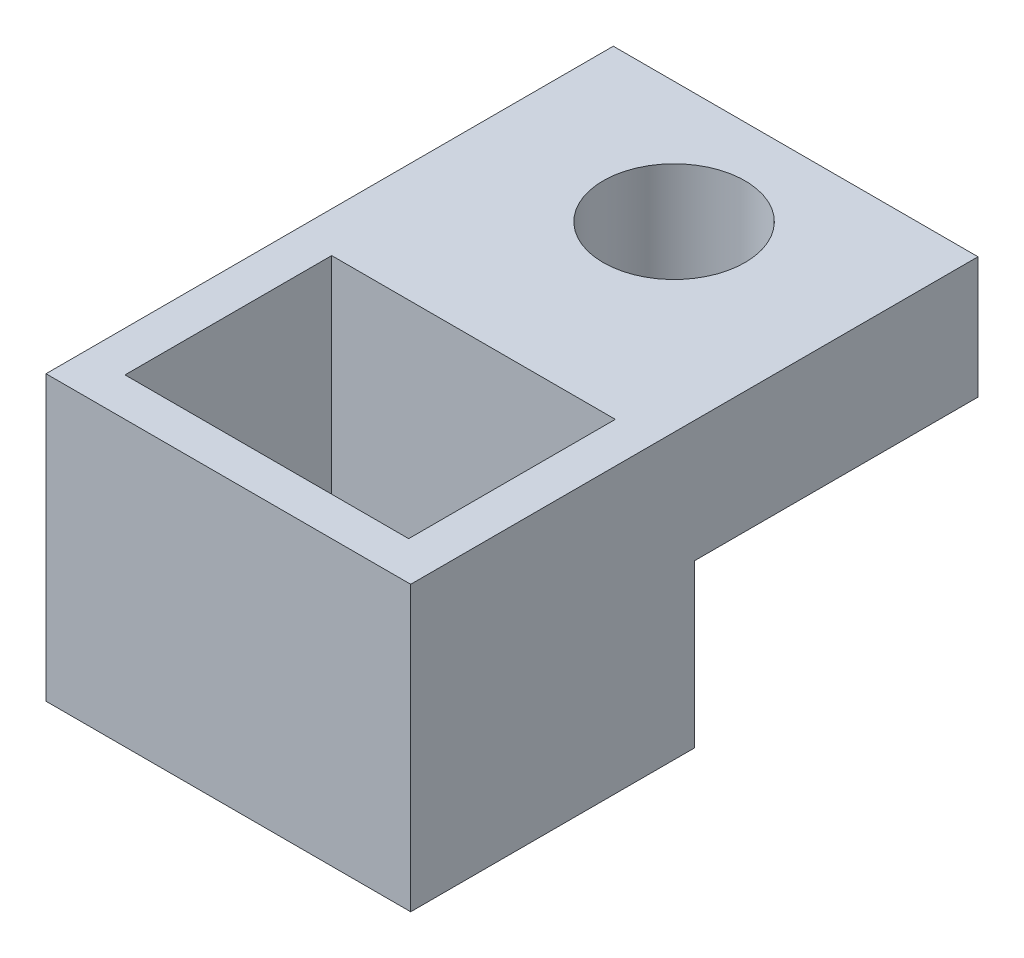
ISO-10303-21;
HEADER;
FILE_DESCRIPTION(('STEP AP214'),'2;1');
FILE_NAME('part.step','',(''),(''),'','','');
FILE_SCHEMA(('AUTOMOTIVE_DESIGN { 1 0 10303 214 1 1 1 1 }'));
ENDSEC;
DATA;
#1=APPLICATION_CONTEXT('core data for automotive mechanical design processes');
#2=APPLICATION_PROTOCOL_DEFINITION('international standard','automotive_design',2000,#1);
#3=PRODUCT_CONTEXT('',#1,'mechanical');
#4=PRODUCT('Part','Part','',(#3));
#5=PRODUCT_RELATED_PRODUCT_CATEGORY('part','',(#4));
#6=PRODUCT_DEFINITION_FORMATION('','',#4);
#7=PRODUCT_DEFINITION_CONTEXT('part definition',#1,'design');
#8=PRODUCT_DEFINITION('design','',#6,#7);
#9=PRODUCT_DEFINITION_SHAPE('','',#8);
#10=(LENGTH_UNIT() NAMED_UNIT(*) SI_UNIT(.MILLI.,.METRE.));
#11=(NAMED_UNIT(*) PLANE_ANGLE_UNIT() SI_UNIT($,.RADIAN.));
#12=(NAMED_UNIT(*) SI_UNIT($,.STERADIAN.) SOLID_ANGLE_UNIT());
#13=UNCERTAINTY_MEASURE_WITH_UNIT(LENGTH_MEASURE(1.E-05),#10,'distance_accuracy_value','');
#14=(GEOMETRIC_REPRESENTATION_CONTEXT(3) GLOBAL_UNCERTAINTY_ASSIGNED_CONTEXT((#13)) GLOBAL_UNIT_ASSIGNED_CONTEXT((#10,
#11,#12)) REPRESENTATION_CONTEXT('',''));
#15=CARTESIAN_POINT('',(0.,0.,0.));
#16=DIRECTION('',(0.,0.,1.));
#17=DIRECTION('',(1.,0.,0.));
#18=AXIS2_PLACEMENT_3D('',#15,#16,#17);
#19=CARTESIAN_POINT('',(9.,0.,-7.));
#20=DIRECTION('',(0.,1.,0.));
#21=DIRECTION('',(0.,0.,1.));
#22=AXIS2_PLACEMENT_3D('',#19,#20,#21);
#23=PLANE('',#22);
#24=CARTESIAN_POINT('',(4.5,0.,-4.));
#25=DIRECTION('',(0.,1.,0.));
#26=DIRECTION('',(0.,0.,1.));
#27=AXIS2_PLACEMENT_3D('',#24,#25,#26);
#28=CIRCLE('',#27,1.75);
#29=CARTESIAN_POINT('',(4.5,0.,-2.25));
#30=VERTEX_POINT('',#29);
#31=EDGE_CURVE('E150',#30,#30,#28,.T.);
#32=ORIENTED_EDGE('',*,*,#31,.T.);
#33=EDGE_LOOP('',(#32));
#34=FACE_BOUND('',#33,.T.);
#35=DIRECTION('',(0.,0.,-1.));
#36=VECTOR('',#35,1.);
#37=CARTESIAN_POINT('',(0.,0.,-7.));
#38=LINE('',#37,#36);
#39=CARTESIAN_POINT('',(0.,0.,0.));
#40=VERTEX_POINT('',#39);
#41=CARTESIAN_POINT('',(0.,0.,-7.));
#42=VERTEX_POINT('',#41);
#43=EDGE_CURVE('E153',#40,#42,#38,.T.);
#44=ORIENTED_EDGE('',*,*,#43,.T.);
#45=DIRECTION('',(-1.,0.,0.));
#46=VECTOR('',#45,1.);
#47=CARTESIAN_POINT('',(9.,0.,-7.));
#48=LINE('',#47,#46);
#49=CARTESIAN_POINT('',(9.,0.,-7.));
#50=VERTEX_POINT('',#49);
#51=EDGE_CURVE('E11',#50,#42,#48,.T.);
#52=ORIENTED_EDGE('',*,*,#51,.F.);
#53=DIRECTION('',(0.,0.,-1.));
#54=VECTOR('',#53,1.);
#55=CARTESIAN_POINT('',(9.,0.,-7.));
#56=LINE('',#55,#54);
#57=CARTESIAN_POINT('',(9.,0.,0.));
#58=VERTEX_POINT('',#57);
#59=EDGE_CURVE('E154',#58,#50,#56,.T.);
#60=ORIENTED_EDGE('',*,*,#59,.F.);
#61=DIRECTION('',(-1.,0.,0.));
#62=VECTOR('',#61,1.);
#63=CARTESIAN_POINT('',(9.,0.,0.));
#64=LINE('',#63,#62);
#65=EDGE_CURVE('E168',#58,#40,#64,.T.);
#66=ORIENTED_EDGE('',*,*,#65,.T.);
#67=EDGE_LOOP('',(#44,#52,#60,#66));
#68=FACE_BOUND('',#67,.T.);
#69=ADVANCED_FACE('F35',(#34,#68),#23,.F.);
#70=CARTESIAN_POINT('',(9.,3.,-7.));
#71=DIRECTION('',(0.,0.,1.));
#72=DIRECTION('',(0.,-1.,0.));
#73=AXIS2_PLACEMENT_3D('',#70,#71,#72);
#74=PLANE('',#73);
#75=DIRECTION('',(0.,1.,0.));
#76=VECTOR('',#75,1.);
#77=CARTESIAN_POINT('',(0.,3.,-7.));
#78=LINE('',#77,#76);
#79=CARTESIAN_POINT('',(0.,3.,-7.));
#80=VERTEX_POINT('',#79);
#81=EDGE_CURVE('E171',#42,#80,#78,.T.);
#82=ORIENTED_EDGE('',*,*,#81,.T.);
#83=DIRECTION('',(-1.,0.,0.));
#84=VECTOR('',#83,1.);
#85=CARTESIAN_POINT('',(9.,3.,-7.));
#86=LINE('',#85,#84);
#87=CARTESIAN_POINT('',(9.,3.,-7.));
#88=VERTEX_POINT('',#87);
#89=EDGE_CURVE('E42',#88,#80,#86,.T.);
#90=ORIENTED_EDGE('',*,*,#89,.F.);
#91=DIRECTION('',(0.,1.,0.));
#92=VECTOR('',#91,1.);
#93=CARTESIAN_POINT('',(9.,3.,-7.));
#94=LINE('',#93,#92);
#95=EDGE_CURVE('E157',#50,#88,#94,.T.);
#96=ORIENTED_EDGE('',*,*,#95,.F.);
#97=ORIENTED_EDGE('',*,*,#51,.T.);
#98=EDGE_LOOP('',(#82,#90,#96,#97));
#99=FACE_BOUND('',#98,.T.);
#100=ADVANCED_FACE('F216',(#99),#74,.F.);
#101=CARTESIAN_POINT('',(9.,3.,7.));
#102=DIRECTION('',(0.,-1.,0.));
#103=DIRECTION('',(0.,0.,-1.));
#104=AXIS2_PLACEMENT_3D('',#101,#102,#103);
#105=PLANE('',#104);
#106=DIRECTION('',(1.,0.,0.));
#107=VECTOR('',#106,1.);
#108=CARTESIAN_POINT('',(1.,3.,6.05));
#109=LINE('',#108,#107);
#110=CARTESIAN_POINT('',(1.,3.,6.05));
#111=VERTEX_POINT('',#110);
#112=CARTESIAN_POINT('',(8.,3.,6.05));
#113=VERTEX_POINT('',#112);
#114=EDGE_CURVE('E138',#111,#113,#109,.T.);
#115=ORIENTED_EDGE('',*,*,#114,.F.);
#116=DIRECTION('',(0.,0.,1.));
#117=VECTOR('',#116,1.);
#118=CARTESIAN_POINT('',(1.,3.,0.950000000000002));
#119=LINE('',#118,#117);
#120=CARTESIAN_POINT('',(1.,3.,0.950000000000002));
#121=VERTEX_POINT('',#120);
#122=EDGE_CURVE('E49',#121,#111,#119,.T.);
#123=ORIENTED_EDGE('',*,*,#122,.F.);
#124=DIRECTION('',(-1.,0.,0.));
#125=VECTOR('',#124,1.);
#126=CARTESIAN_POINT('',(1.,3.,0.950000000000002));
#127=LINE('',#126,#125);
#128=CARTESIAN_POINT('',(8.,3.,0.949999999999998));
#129=VERTEX_POINT('',#128);
#130=EDGE_CURVE('E129',#129,#121,#127,.T.);
#131=ORIENTED_EDGE('',*,*,#130,.F.);
#132=DIRECTION('',(0.,0.,-1.));
#133=VECTOR('',#132,1.);
#134=CARTESIAN_POINT('',(8.,3.,0.949999999999998));
#135=LINE('',#134,#133);
#136=EDGE_CURVE('E132',#113,#129,#135,.T.);
#137=ORIENTED_EDGE('',*,*,#136,.F.);
#138=EDGE_LOOP('',(#115,#123,#131,#137));
#139=FACE_BOUND('',#138,.T.);
#140=CARTESIAN_POINT('',(4.5,3.,-4.));
#141=DIRECTION('',(0.,1.,0.));
#142=DIRECTION('',(0.,0.,1.));
#143=AXIS2_PLACEMENT_3D('',#140,#141,#142);
#144=CIRCLE('',#143,1.75);
#145=CARTESIAN_POINT('',(4.5,3.,-2.25));
#146=VERTEX_POINT('',#145);
#147=EDGE_CURVE('E144',#146,#146,#144,.T.);
#148=ORIENTED_EDGE('',*,*,#147,.F.);
#149=EDGE_LOOP('',(#148));
#150=FACE_BOUND('',#149,.T.);
#151=DIRECTION('',(0.,0.,1.));
#152=VECTOR('',#151,1.);
#153=CARTESIAN_POINT('',(0.,3.,7.));
#154=LINE('',#153,#152);
#155=CARTESIAN_POINT('',(0.,3.,7.));
#156=VERTEX_POINT('',#155);
#157=EDGE_CURVE('E173',#80,#156,#154,.T.);
#158=ORIENTED_EDGE('',*,*,#157,.T.);
#159=DIRECTION('',(-1.,0.,0.));
#160=VECTOR('',#159,1.);
#161=CARTESIAN_POINT('',(9.,3.,7.));
#162=LINE('',#161,#160);
#163=CARTESIAN_POINT('',(9.,3.,7.));
#164=VERTEX_POINT('',#163);
#165=EDGE_CURVE('E188',#164,#156,#162,.T.);
#166=ORIENTED_EDGE('',*,*,#165,.F.);
#167=DIRECTION('',(0.,0.,1.));
#168=VECTOR('',#167,1.);
#169=CARTESIAN_POINT('',(9.,3.,7.));
#170=LINE('',#169,#168);
#171=EDGE_CURVE('E160',#88,#164,#170,.T.);
#172=ORIENTED_EDGE('',*,*,#171,.F.);
#173=ORIENTED_EDGE('',*,*,#89,.T.);
#174=EDGE_LOOP('',(#158,#166,#172,#173));
#175=FACE_BOUND('',#174,.T.);
#176=ADVANCED_FACE('F195',(#139,#150,#175),#105,.F.);
#177=CARTESIAN_POINT('',(9.,-4.,7.));
#178=DIRECTION('',(0.,0.,-1.));
#179=DIRECTION('',(-1.,0.,0.));
#180=AXIS2_PLACEMENT_3D('',#177,#178,#179);
#181=PLANE('',#180);
#182=DIRECTION('',(0.,-1.,0.));
#183=VECTOR('',#182,1.);
#184=CARTESIAN_POINT('',(0.,-4.,7.));
#185=LINE('',#184,#183);
#186=CARTESIAN_POINT('',(0.,-4.,7.));
#187=VERTEX_POINT('',#186);
#188=EDGE_CURVE('E175',#156,#187,#185,.T.);
#189=ORIENTED_EDGE('',*,*,#188,.T.);
#190=DIRECTION('',(-1.,0.,0.));
#191=VECTOR('',#190,1.);
#192=CARTESIAN_POINT('',(9.,-4.,7.));
#193=LINE('',#192,#191);
#194=CARTESIAN_POINT('',(9.,-4.,7.));
#195=VERTEX_POINT('',#194);
#196=EDGE_CURVE('E185',#195,#187,#193,.T.);
#197=ORIENTED_EDGE('',*,*,#196,.F.);
#198=DIRECTION('',(0.,-1.,0.));
#199=VECTOR('',#198,1.);
#200=CARTESIAN_POINT('',(9.,-4.,7.));
#201=LINE('',#200,#199);
#202=EDGE_CURVE('E162',#164,#195,#201,.T.);
#203=ORIENTED_EDGE('',*,*,#202,.F.);
#204=ORIENTED_EDGE('',*,*,#165,.T.);
#205=EDGE_LOOP('',(#189,#197,#203,#204));
#206=FACE_BOUND('',#205,.T.);
#207=ADVANCED_FACE('F206',(#206),#181,.F.);
#208=CARTESIAN_POINT('',(9.,-4.,0.));
#209=DIRECTION('',(0.,1.,0.));
#210=DIRECTION('',(0.,0.,1.));
#211=AXIS2_PLACEMENT_3D('',#208,#209,#210);
#212=PLANE('',#211);
#213=DIRECTION('',(-1.,0.,0.));
#214=VECTOR('',#213,1.);
#215=CARTESIAN_POINT('',(1.,-4.,0.950000000000002));
#216=LINE('',#215,#214);
#217=CARTESIAN_POINT('',(8.,-4.,0.949999999999998));
#218=VERTEX_POINT('',#217);
#219=CARTESIAN_POINT('',(1.,-4.,0.950000000000002));
#220=VERTEX_POINT('',#219);
#221=EDGE_CURVE('E119',#218,#220,#216,.T.);
#222=ORIENTED_EDGE('',*,*,#221,.T.);
#223=DIRECTION('',(0.,0.,1.));
#224=VECTOR('',#223,1.);
#225=CARTESIAN_POINT('',(1.,-4.,0.950000000000002));
#226=LINE('',#225,#224);
#227=CARTESIAN_POINT('',(1.,-4.,6.05));
#228=VERTEX_POINT('',#227);
#229=EDGE_CURVE('E113',#220,#228,#226,.T.);
#230=ORIENTED_EDGE('',*,*,#229,.T.);
#231=DIRECTION('',(1.,0.,0.));
#232=VECTOR('',#231,1.);
#233=CARTESIAN_POINT('',(1.,-4.,6.05));
#234=LINE('',#233,#232);
#235=CARTESIAN_POINT('',(8.,-4.,6.05));
#236=VERTEX_POINT('',#235);
#237=EDGE_CURVE('E122',#228,#236,#234,.T.);
#238=ORIENTED_EDGE('',*,*,#237,.T.);
#239=DIRECTION('',(0.,0.,-1.));
#240=VECTOR('',#239,1.);
#241=CARTESIAN_POINT('',(8.,-4.,0.949999999999998));
#242=LINE('',#241,#240);
#243=EDGE_CURVE('E57',#236,#218,#242,.T.);
#244=ORIENTED_EDGE('',*,*,#243,.T.);
#245=EDGE_LOOP('',(#222,#230,#238,#244));
#246=FACE_BOUND('',#245,.T.);
#247=DIRECTION('',(0.,0.,-1.));
#248=VECTOR('',#247,1.);
#249=CARTESIAN_POINT('',(0.,-4.,0.));
#250=LINE('',#249,#248);
#251=CARTESIAN_POINT('',(0.,-4.,0.));
#252=VERTEX_POINT('',#251);
#253=EDGE_CURVE('E177',#187,#252,#250,.T.);
#254=ORIENTED_EDGE('',*,*,#253,.T.);
#255=DIRECTION('',(-1.,0.,0.));
#256=VECTOR('',#255,1.);
#257=CARTESIAN_POINT('',(9.,-4.,0.));
#258=LINE('',#257,#256);
#259=CARTESIAN_POINT('',(9.,-4.,0.));
#260=VERTEX_POINT('',#259);
#261=EDGE_CURVE('E182',#260,#252,#258,.T.);
#262=ORIENTED_EDGE('',*,*,#261,.F.);
#263=DIRECTION('',(0.,0.,-1.));
#264=VECTOR('',#263,1.);
#265=CARTESIAN_POINT('',(9.,-4.,0.));
#266=LINE('',#265,#264);
#267=EDGE_CURVE('E164',#195,#260,#266,.T.);
#268=ORIENTED_EDGE('',*,*,#267,.F.);
#269=ORIENTED_EDGE('',*,*,#196,.T.);
#270=EDGE_LOOP('',(#254,#262,#268,#269));
#271=FACE_BOUND('',#270,.T.);
#272=ADVANCED_FACE('F126',(#246,#271),#212,.F.);
#273=CARTESIAN_POINT('',(9.,0.,0.));
#274=DIRECTION('',(0.,0.,1.));
#275=DIRECTION('',(0.,-1.,0.));
#276=AXIS2_PLACEMENT_3D('',#273,#274,#275);
#277=PLANE('',#276);
#278=DIRECTION('',(0.,1.,0.));
#279=VECTOR('',#278,1.);
#280=CARTESIAN_POINT('',(0.,0.,0.));
#281=LINE('',#280,#279);
#282=EDGE_CURVE('E158',#252,#40,#281,.T.);
#283=ORIENTED_EDGE('',*,*,#282,.T.);
#284=ORIENTED_EDGE('',*,*,#65,.F.);
#285=DIRECTION('',(0.,1.,0.));
#286=VECTOR('',#285,1.);
#287=CARTESIAN_POINT('',(9.,0.,0.));
#288=LINE('',#287,#286);
#289=EDGE_CURVE('E166',#260,#58,#288,.T.);
#290=ORIENTED_EDGE('',*,*,#289,.F.);
#291=ORIENTED_EDGE('',*,*,#261,.T.);
#292=EDGE_LOOP('',(#283,#284,#290,#291));
#293=FACE_BOUND('',#292,.T.);
#294=ADVANCED_FACE('F219',(#293),#277,.F.);
#295=CARTESIAN_POINT('',(9.,0.,0.));
#296=DIRECTION('',(1.,0.,0.));
#297=DIRECTION('',(0.,0.,-1.));
#298=AXIS2_PLACEMENT_3D('',#295,#296,#297);
#299=PLANE('',#298);
#300=ORIENTED_EDGE('',*,*,#59,.T.);
#301=ORIENTED_EDGE('',*,*,#95,.T.);
#302=ORIENTED_EDGE('',*,*,#171,.T.);
#303=ORIENTED_EDGE('',*,*,#202,.T.);
#304=ORIENTED_EDGE('',*,*,#267,.T.);
#305=ORIENTED_EDGE('',*,*,#289,.T.);
#306=EDGE_LOOP('',(#300,#301,#302,#303,#304,#305));
#307=FACE_BOUND('',#306,.T.);
#308=ADVANCED_FACE('F212',(#307),#299,.T.);
#309=CARTESIAN_POINT('',(0.,0.,0.));
#310=DIRECTION('',(1.,0.,0.));
#311=DIRECTION('',(0.,0.,-1.));
#312=AXIS2_PLACEMENT_3D('',#309,#310,#311);
#313=PLANE('',#312);
#314=ORIENTED_EDGE('',*,*,#43,.F.);
#315=ORIENTED_EDGE('',*,*,#282,.F.);
#316=ORIENTED_EDGE('',*,*,#253,.F.);
#317=ORIENTED_EDGE('',*,*,#188,.F.);
#318=ORIENTED_EDGE('',*,*,#157,.F.);
#319=ORIENTED_EDGE('',*,*,#81,.F.);
#320=EDGE_LOOP('',(#314,#315,#316,#317,#318,#319));
#321=FACE_BOUND('',#320,.T.);
#322=ADVANCED_FACE('F201',(#321),#313,.F.);
#323=CARTESIAN_POINT('',(4.5,-4.,-4.));
#324=DIRECTION('',(0.,1.,0.));
#325=DIRECTION('',(0.,0.,1.));
#326=AXIS2_PLACEMENT_3D('',#323,#324,#325);
#327=CYLINDRICAL_SURFACE('',#326,1.75);
#328=ORIENTED_EDGE('',*,*,#147,.T.);
#329=EDGE_LOOP('',(#328));
#330=FACE_BOUND('',#329,.T.);
#331=ORIENTED_EDGE('',*,*,#31,.F.);
#332=EDGE_LOOP('',(#331));
#333=FACE_BOUND('',#332,.T.);
#334=ADVANCED_FACE('F236',(#330,#333),#327,.F.);
#335=CARTESIAN_POINT('',(1.,-4.,0.950000000000002));
#336=DIRECTION('',(-1.,0.,0.));
#337=DIRECTION('',(0.,0.,1.));
#338=AXIS2_PLACEMENT_3D('',#335,#336,#337);
#339=PLANE('',#338);
#340=ORIENTED_EDGE('',*,*,#122,.T.);
#341=DIRECTION('',(0.,1.,0.));
#342=VECTOR('',#341,1.);
#343=CARTESIAN_POINT('',(1.,-4.,6.05));
#344=LINE('',#343,#342);
#345=EDGE_CURVE('E109',#228,#111,#344,.T.);
#346=ORIENTED_EDGE('',*,*,#345,.F.);
#347=ORIENTED_EDGE('',*,*,#229,.F.);
#348=DIRECTION('',(0.,1.,0.));
#349=VECTOR('',#348,1.);
#350=CARTESIAN_POINT('',(1.,-4.,0.950000000000002));
#351=LINE('',#350,#349);
#352=EDGE_CURVE('E142',#220,#121,#351,.T.);
#353=ORIENTED_EDGE('',*,*,#352,.T.);
#354=EDGE_LOOP('',(#340,#346,#347,#353));
#355=FACE_BOUND('',#354,.T.);
#356=ADVANCED_FACE('F111',(#355),#339,.F.);
#357=CARTESIAN_POINT('',(1.,-4.,0.950000000000002));
#358=DIRECTION('',(0.,0.,-1.));
#359=DIRECTION('',(-1.,0.,0.));
#360=AXIS2_PLACEMENT_3D('',#357,#358,#359);
#361=PLANE('',#360);
#362=ORIENTED_EDGE('',*,*,#130,.T.);
#363=ORIENTED_EDGE('',*,*,#352,.F.);
#364=ORIENTED_EDGE('',*,*,#221,.F.);
#365=DIRECTION('',(0.,1.,0.));
#366=VECTOR('',#365,1.);
#367=CARTESIAN_POINT('',(8.,-4.,0.949999999999998));
#368=LINE('',#367,#366);
#369=EDGE_CURVE('E145',#218,#129,#368,.T.);
#370=ORIENTED_EDGE('',*,*,#369,.T.);
#371=EDGE_LOOP('',(#362,#363,#364,#370));
#372=FACE_BOUND('',#371,.T.);
#373=ADVANCED_FACE('F244',(#372),#361,.F.);
#374=CARTESIAN_POINT('',(8.,-4.,0.949999999999998));
#375=DIRECTION('',(1.,0.,0.));
#376=DIRECTION('',(0.,0.,-1.));
#377=AXIS2_PLACEMENT_3D('',#374,#375,#376);
#378=PLANE('',#377);
#379=ORIENTED_EDGE('',*,*,#136,.T.);
#380=ORIENTED_EDGE('',*,*,#369,.F.);
#381=ORIENTED_EDGE('',*,*,#243,.F.);
#382=DIRECTION('',(0.,1.,0.));
#383=VECTOR('',#382,1.);
#384=CARTESIAN_POINT('',(8.,-4.,6.05));
#385=LINE('',#384,#383);
#386=EDGE_CURVE('E118',#236,#113,#385,.T.);
#387=ORIENTED_EDGE('',*,*,#386,.T.);
#388=EDGE_LOOP('',(#379,#380,#381,#387));
#389=FACE_BOUND('',#388,.T.);
#390=ADVANCED_FACE('F249',(#389),#378,.F.);
#391=CARTESIAN_POINT('',(1.,-4.,6.05));
#392=DIRECTION('',(0.,0.,1.));
#393=DIRECTION('',(0.,-1.,0.));
#394=AXIS2_PLACEMENT_3D('',#391,#392,#393);
#395=PLANE('',#394);
#396=ORIENTED_EDGE('',*,*,#114,.T.);
#397=ORIENTED_EDGE('',*,*,#386,.F.);
#398=ORIENTED_EDGE('',*,*,#237,.F.);
#399=ORIENTED_EDGE('',*,*,#345,.T.);
#400=EDGE_LOOP('',(#396,#397,#398,#399));
#401=FACE_BOUND('',#400,.T.);
#402=ADVANCED_FACE('F123',(#401),#395,.F.);
#403=CLOSED_SHELL('',(#69,#100,#176,#207,#272,#294,#308,#322,#334,#356,#373,#390,#402));
#404=MANIFOLD_SOLID_BREP('B2',#403);
#405=ADVANCED_BREP_SHAPE_REPRESENTATION('',(#18,#404),#14);
#406=SHAPE_DEFINITION_REPRESENTATION(#9,#405);
ENDSEC;
END-ISO-10303-21;
